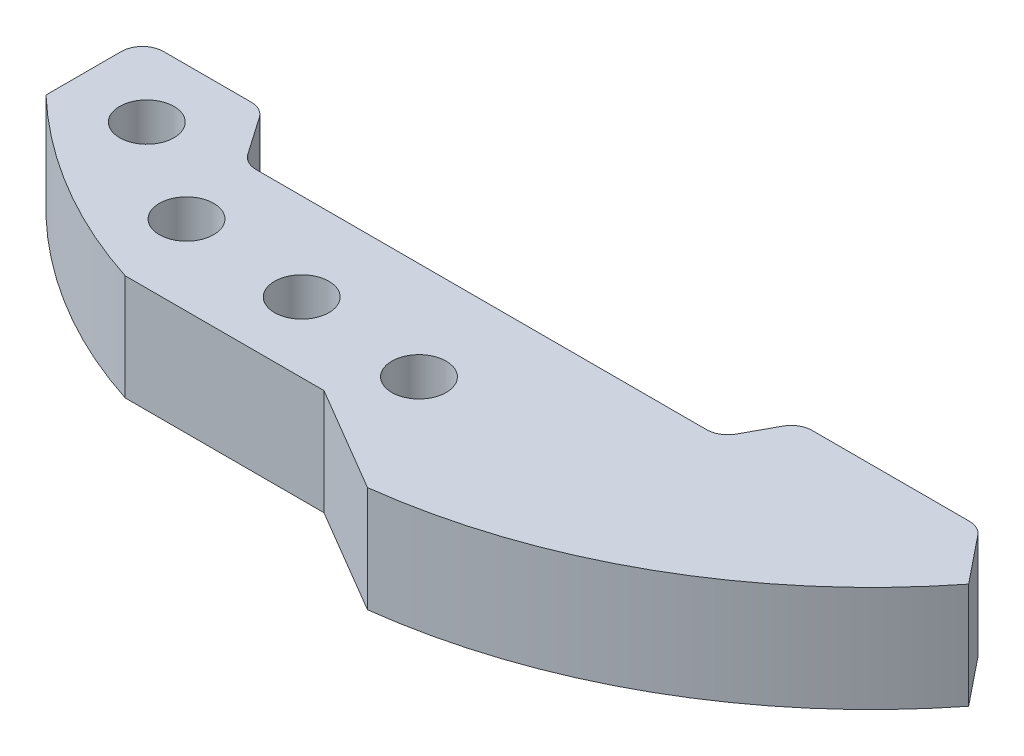
ISO-10303-21;
HEADER;
FILE_DESCRIPTION(('STEP AP214'),'2;1');
FILE_NAME('part.step','',(''),(''),'','','');
FILE_SCHEMA(('AUTOMOTIVE_DESIGN { 1 0 10303 214 1 1 1 1 }'));
ENDSEC;
DATA;
#1=APPLICATION_CONTEXT('core data for automotive mechanical design processes');
#2=APPLICATION_PROTOCOL_DEFINITION('international standard','automotive_design',2000,#1);
#3=PRODUCT_CONTEXT('',#1,'mechanical');
#4=PRODUCT('Part','Part','',(#3));
#5=PRODUCT_RELATED_PRODUCT_CATEGORY('part','',(#4));
#6=PRODUCT_DEFINITION_FORMATION('','',#4);
#7=PRODUCT_DEFINITION_CONTEXT('part definition',#1,'design');
#8=PRODUCT_DEFINITION('design','',#6,#7);
#9=PRODUCT_DEFINITION_SHAPE('','',#8);
#10=(LENGTH_UNIT() NAMED_UNIT(*) SI_UNIT(.MILLI.,.METRE.));
#11=(NAMED_UNIT(*) PLANE_ANGLE_UNIT() SI_UNIT($,.RADIAN.));
#12=(NAMED_UNIT(*) SI_UNIT($,.STERADIAN.) SOLID_ANGLE_UNIT());
#13=UNCERTAINTY_MEASURE_WITH_UNIT(LENGTH_MEASURE(1.E-05),#10,'distance_accuracy_value','');
#14=(GEOMETRIC_REPRESENTATION_CONTEXT(3) GLOBAL_UNCERTAINTY_ASSIGNED_CONTEXT((#13)) GLOBAL_UNIT_ASSIGNED_CONTEXT((#10,
#11,#12)) REPRESENTATION_CONTEXT('',''));
#15=CARTESIAN_POINT('',(0.,0.,0.));
#16=DIRECTION('',(0.,0.,1.));
#17=DIRECTION('',(1.,0.,0.));
#18=AXIS2_PLACEMENT_3D('',#15,#16,#17);
#19=CARTESIAN_POINT('',(-8.87325336655043,12.7,-2.54000000000001));
#20=DIRECTION('',(0.,-1.,0.));
#21=DIRECTION('',(0.,0.,-1.));
#22=AXIS2_PLACEMENT_3D('',#19,#20,#21);
#23=PLANE('',#22);
#24=CARTESIAN_POINT('',(7.10700109824777,12.7,10.5038351274323));
#25=DIRECTION('',(0.,1.,0.));
#26=DIRECTION('',(0.,0.,1.));
#27=AXIS2_PLACEMENT_3D('',#24,#25,#26);
#28=CIRCLE('',#27,3.2639);
#29=CARTESIAN_POINT('',(7.10700109824777,12.7,13.7677351274323));
#30=VERTEX_POINT('',#29);
#31=EDGE_CURVE('E355',#30,#30,#28,.T.);
#32=ORIENTED_EDGE('',*,*,#31,.F.);
#33=EDGE_LOOP('',(#32));
#34=FACE_BOUND('',#33,.T.);
#35=CARTESIAN_POINT('',(-20.3687877982319,12.7,1.62422244397765));
#36=DIRECTION('',(0.,1.,0.));
#37=DIRECTION('',(0.,0.,1.));
#38=AXIS2_PLACEMENT_3D('',#35,#36,#37);
#39=CIRCLE('',#38,3.2639);
#40=CARTESIAN_POINT('',(-20.3687877982319,12.7,4.88812244397765));
#41=VERTEX_POINT('',#40);
#42=EDGE_CURVE('E186',#41,#41,#39,.T.);
#43=ORIENTED_EDGE('',*,*,#42,.F.);
#44=EDGE_LOOP('',(#43));
#45=FACE_BOUND('',#44,.T.);
#46=CARTESIAN_POINT('',(-8.87325336655043,12.7,-2.54000000000001));
#47=DIRECTION('',(0.,-1.,0.));
#48=DIRECTION('',(0.,0.,-1.));
#49=AXIS2_PLACEMENT_3D('',#46,#47,#48);
#50=CIRCLE('',#49,2.54000000000001);
#51=CARTESIAN_POINT('',(-8.87325336655043,12.7,0.));
#52=VERTEX_POINT('',#51);
#53=CARTESIAN_POINT('',(-10.9603491429216,12.7,-1.0923704823907));
#54=VERTEX_POINT('',#53);
#55=EDGE_CURVE('E215',#52,#54,#50,.T.);
#56=ORIENTED_EDGE('',*,*,#55,.T.);
#57=DIRECTION('',(-0.569932880948545,0.,-0.821691250539819));
#58=VECTOR('',#57,1.);
#59=CARTESIAN_POINT('',(-14.1041656400549,12.7,-5.62491562121108));
#60=LINE('',#59,#58);
#61=CARTESIAN_POINT('',(-14.1041656400549,12.7,-5.62491562121108));
#62=VERTEX_POINT('',#61);
#63=EDGE_CURVE('E118',#54,#62,#60,.T.);
#64=ORIENTED_EDGE('',*,*,#63,.T.);
#65=CARTESIAN_POINT('',(-16.1912614164261,12.7,-4.17728610360175));
#66=DIRECTION('',(0.,1.,0.));
#67=DIRECTION('',(0.,0.,-1.));
#68=AXIS2_PLACEMENT_3D('',#65,#66,#67);
#69=CIRCLE('',#68,2.54000000000002);
#70=CARTESIAN_POINT('',(-16.1912614164261,12.7,-6.71728610360177));
#71=VERTEX_POINT('',#70);
#72=EDGE_CURVE('E257',#62,#71,#69,.T.);
#73=ORIENTED_EDGE('',*,*,#72,.T.);
#74=DIRECTION('',(-1.,0.,0.));
#75=VECTOR('',#74,1.);
#76=CARTESIAN_POINT('',(-26.693758610171,12.7,-6.71728610360177));
#77=LINE('',#76,#75);
#78=CARTESIAN_POINT('',(-26.693758610171,12.7,-6.71728610360177));
#79=VERTEX_POINT('',#78);
#80=EDGE_CURVE('E276',#71,#79,#77,.T.);
#81=ORIENTED_EDGE('',*,*,#80,.T.);
#82=CARTESIAN_POINT('',(-26.693758610171,12.7,-4.17728610360177));
#83=DIRECTION('',(0.,1.,0.));
#84=DIRECTION('',(0.,0.,1.));
#85=AXIS2_PLACEMENT_3D('',#82,#83,#84);
#86=CIRCLE('',#85,2.54);
#87=CARTESIAN_POINT('',(-29.233758610171,12.7,-4.17728610360177));
#88=VERTEX_POINT('',#87);
#89=EDGE_CURVE('E273',#79,#88,#86,.T.);
#90=ORIENTED_EDGE('',*,*,#89,.T.);
#91=DIRECTION('',(0.,0.,1.));
#92=VECTOR('',#91,1.);
#93=CARTESIAN_POINT('',(-29.233758610171,12.7,4.85526249752581));
#94=LINE('',#93,#92);
#95=CARTESIAN_POINT('',(-29.233758610171,12.7,4.85526249752581));
#96=VERTEX_POINT('',#95);
#97=EDGE_CURVE('E275',#88,#96,#94,.T.);
#98=ORIENTED_EDGE('',*,*,#97,.T.);
#99=CARTESIAN_POINT('',(13.2373230450573,12.7,-39.6028183966999));
#100=DIRECTION('',(0.,1.,0.));
#101=DIRECTION('',(0.,0.,1.));
#102=AXIS2_PLACEMENT_3D('',#99,#100,#101);
#103=CIRCLE('',#102,61.4842559828334);
#104=CARTESIAN_POINT('',(-5.68881718617444,12.7,18.8960273159322));
#105=VERTEX_POINT('',#104);
#106=EDGE_CURVE('E278',#96,#105,#103,.T.);
#107=ORIENTED_EDGE('',*,*,#106,.T.);
#108=DIRECTION('',(1.,0.,0.));
#109=VECTOR('',#108,1.);
#110=CARTESIAN_POINT('',(18.1655195514172,12.7,18.8960273159322));
#111=LINE('',#110,#109);
#112=CARTESIAN_POINT('',(18.1655195514172,12.7,18.8960273159322));
#113=VERTEX_POINT('',#112);
#114=EDGE_CURVE('E284',#105,#113,#111,.T.);
#115=ORIENTED_EDGE('',*,*,#114,.T.);
#116=DIRECTION('',(0.861850565348873,0.,0.507162304403461));
#117=VECTOR('',#116,1.);
#118=CARTESIAN_POINT('',(30.8655195514172,12.7,26.3694357290446));
#119=LINE('',#118,#117);
#120=CARTESIAN_POINT('',(30.8655195514172,12.7,26.3694357290446));
#121=VERTEX_POINT('',#120);
#122=EDGE_CURVE('E286',#113,#121,#119,.T.);
#123=ORIENTED_EDGE('',*,*,#122,.T.);
#124=CARTESIAN_POINT('',(22.208753694901,12.7,-42.7961792049553));
#125=DIRECTION('',(0.,1.,0.));
#126=DIRECTION('',(0.,0.,1.));
#127=AXIS2_PLACEMENT_3D('',#124,#125,#126);
#128=CIRCLE('',#127,69.7052500482776);
#129=CARTESIAN_POINT('',(76.9724106715689,12.7,0.328799158340741));
#130=VERTEX_POINT('',#129);
#131=EDGE_CURVE('E288',#121,#130,#128,.T.);
#132=ORIENTED_EDGE('',*,*,#131,.T.);
#133=DIRECTION('',(-0.626647693307353,0.,-0.779302680909397));
#134=VECTOR('',#133,1.);
#135=CARTESIAN_POINT('',(72.4415160323198,12.7,-5.30584751313917));
#136=LINE('',#135,#134);
#137=CARTESIAN_POINT('',(72.4415160323198,12.7,-5.30584751313917));
#138=VERTEX_POINT('',#137);
#139=EDGE_CURVE('E290',#130,#138,#136,.T.);
#140=ORIENTED_EDGE('',*,*,#139,.T.);
#141=CARTESIAN_POINT('',(70.46208722281,12.7,-3.71416237213849));
#142=DIRECTION('',(0.,1.,0.));
#143=DIRECTION('',(0.,0.,-1.));
#144=AXIS2_PLACEMENT_3D('',#141,#142,#143);
#145=CIRCLE('',#144,2.54000000000001);
#146=CARTESIAN_POINT('',(70.46208722281,12.7,-6.2541623721385));
#147=VERTEX_POINT('',#146);
#148=EDGE_CURVE('E292',#138,#147,#145,.T.);
#149=ORIENTED_EDGE('',*,*,#148,.T.);
#150=DIRECTION('',(-1.,0.,0.));
#151=VECTOR('',#150,1.);
#152=CARTESIAN_POINT('',(51.6232888953784,12.7,-6.2541623721385));
#153=LINE('',#152,#151);
#154=CARTESIAN_POINT('',(51.6232888953784,12.7,-6.2541623721385));
#155=VERTEX_POINT('',#154);
#156=EDGE_CURVE('E294',#147,#155,#153,.T.);
#157=ORIENTED_EDGE('',*,*,#156,.T.);
#158=CARTESIAN_POINT('',(51.6232888953784,12.7,-3.71416237213848));
#159=DIRECTION('',(0.,1.,0.));
#160=DIRECTION('',(0.,0.,1.));
#161=AXIS2_PLACEMENT_3D('',#158,#159,#160);
#162=CIRCLE('',#161,2.54000000000002);
#163=CARTESIAN_POINT('',(49.3913485967309,12.7,-4.92661546536457));
#164=VERTEX_POINT('',#163);
#165=EDGE_CURVE('E164',#155,#164,#162,.T.);
#166=ORIENTED_EDGE('',*,*,#165,.T.);
#167=DIRECTION('',(-0.477343737490577,0.,0.878716653010814));
#168=VECTOR('',#167,1.);
#169=CARTESIAN_POINT('',(49.3913485967309,12.7,-4.92661546536457));
#170=LINE('',#169,#168);
#171=CARTESIAN_POINT('',(47.4362327680324,12.7,-1.32754690677394));
#172=VERTEX_POINT('',#171);
#173=EDGE_CURVE('E158',#164,#172,#170,.T.);
#174=ORIENTED_EDGE('',*,*,#173,.T.);
#175=CARTESIAN_POINT('',(45.2042924693849,12.7,-2.54));
#176=DIRECTION('',(0.,-1.,0.));
#177=DIRECTION('',(0.,0.,1.));
#178=AXIS2_PLACEMENT_3D('',#175,#176,#177);
#179=CIRCLE('',#178,2.54000000000001);
#180=CARTESIAN_POINT('',(45.2042924693849,12.7,0.));
#181=VERTEX_POINT('',#180);
#182=EDGE_CURVE('E162',#172,#181,#179,.T.);
#183=ORIENTED_EDGE('',*,*,#182,.T.);
#184=DIRECTION('',(-1.,0.,0.));
#185=VECTOR('',#184,1.);
#186=CARTESIAN_POINT('',(-8.87325336655043,12.7,0.));
#187=LINE('',#186,#185);
#188=EDGE_CURVE('E48',#181,#52,#187,.T.);
#189=ORIENTED_EDGE('',*,*,#188,.T.);
#190=EDGE_LOOP('',(#56,#64,#73,#81,#90,#98,#107,#115,#123,#132,#140,#149,#157,#166,#174,#183,#189));
#191=FACE_BOUND('',#190,.T.);
#192=CARTESIAN_POINT('',(-7.90836526641105,12.7,9.31714485622794));
#193=DIRECTION('',(0.,1.,0.));
#194=DIRECTION('',(0.,0.,1.));
#195=AXIS2_PLACEMENT_3D('',#192,#193,#194);
#196=CIRCLE('',#195,3.2639);
#197=CARTESIAN_POINT('',(-7.90836526641105,12.7,12.5810448562279));
#198=VERTEX_POINT('',#197);
#199=EDGE_CURVE('E361',#198,#198,#196,.T.);
#200=ORIENTED_EDGE('',*,*,#199,.F.);
#201=EDGE_LOOP('',(#200));
#202=FACE_BOUND('',#201,.T.);
#203=CARTESIAN_POINT('',(22.4448241892799,12.7,11.7674823636149));
#204=DIRECTION('',(0.,1.,0.));
#205=DIRECTION('',(0.,0.,1.));
#206=AXIS2_PLACEMENT_3D('',#203,#204,#205);
#207=CIRCLE('',#206,3.2639);
#208=CARTESIAN_POINT('',(22.4448241892799,12.7,15.0313823636149));
#209=VERTEX_POINT('',#208);
#210=EDGE_CURVE('E346',#209,#209,#207,.T.);
#211=ORIENTED_EDGE('',*,*,#210,.F.);
#212=EDGE_LOOP('',(#211));
#213=FACE_BOUND('',#212,.T.);
#214=ADVANCED_FACE('F31',(#34,#45,#191,#202,#213),#23,.F.);
#215=CARTESIAN_POINT('',(-8.87325336655043,0.,-2.54000000000001));
#216=DIRECTION('',(0.,-1.,0.));
#217=DIRECTION('',(0.,0.,-1.));
#218=AXIS2_PLACEMENT_3D('',#215,#216,#217);
#219=PLANE('',#218);
#220=CARTESIAN_POINT('',(7.10700109824777,0.,10.5038351274323));
#221=DIRECTION('',(0.,1.,0.));
#222=DIRECTION('',(0.,0.,1.));
#223=AXIS2_PLACEMENT_3D('',#220,#221,#222);
#224=CIRCLE('',#223,3.2639);
#225=CARTESIAN_POINT('',(7.10700109824777,0.,13.7677351274323));
#226=VERTEX_POINT('',#225);
#227=EDGE_CURVE('E352',#226,#226,#224,.T.);
#228=ORIENTED_EDGE('',*,*,#227,.T.);
#229=EDGE_LOOP('',(#228));
#230=FACE_BOUND('',#229,.T.);
#231=CARTESIAN_POINT('',(-20.3687877982319,0.,1.62422244397765));
#232=DIRECTION('',(0.,1.,0.));
#233=DIRECTION('',(0.,0.,1.));
#234=AXIS2_PLACEMENT_3D('',#231,#232,#233);
#235=CIRCLE('',#234,3.2639);
#236=CARTESIAN_POINT('',(-20.3687877982319,0.,4.88812244397765));
#237=VERTEX_POINT('',#236);
#238=EDGE_CURVE('E364',#237,#237,#235,.T.);
#239=ORIENTED_EDGE('',*,*,#238,.T.);
#240=EDGE_LOOP('',(#239));
#241=FACE_BOUND('',#240,.T.);
#242=CARTESIAN_POINT('',(-8.87325336655043,0.,-2.54000000000001));
#243=DIRECTION('',(0.,-1.,0.));
#244=DIRECTION('',(0.,0.,-1.));
#245=AXIS2_PLACEMENT_3D('',#242,#243,#244);
#246=CIRCLE('',#245,2.54000000000001);
#247=CARTESIAN_POINT('',(-8.87325336655043,0.,0.));
#248=VERTEX_POINT('',#247);
#249=CARTESIAN_POINT('',(-10.9603491429216,0.,-1.0923704823907));
#250=VERTEX_POINT('',#249);
#251=EDGE_CURVE('E182',#248,#250,#246,.T.);
#252=ORIENTED_EDGE('',*,*,#251,.F.);
#253=DIRECTION('',(-1.,0.,0.));
#254=VECTOR('',#253,1.);
#255=CARTESIAN_POINT('',(-8.87325336655043,0.,0.));
#256=LINE('',#255,#254);
#257=CARTESIAN_POINT('',(45.2042924693849,0.,0.));
#258=VERTEX_POINT('',#257);
#259=EDGE_CURVE('E110',#258,#248,#256,.T.);
#260=ORIENTED_EDGE('',*,*,#259,.F.);
#261=CARTESIAN_POINT('',(45.2042924693849,0.,-2.54));
#262=DIRECTION('',(0.,-1.,0.));
#263=DIRECTION('',(0.,0.,1.));
#264=AXIS2_PLACEMENT_3D('',#261,#262,#263);
#265=CIRCLE('',#264,2.54000000000001);
#266=CARTESIAN_POINT('',(47.4362327680324,0.,-1.32754690677394));
#267=VERTEX_POINT('',#266);
#268=EDGE_CURVE('E104',#267,#258,#265,.T.);
#269=ORIENTED_EDGE('',*,*,#268,.F.);
#270=DIRECTION('',(-0.477343737490577,0.,0.878716653010814));
#271=VECTOR('',#270,1.);
#272=CARTESIAN_POINT('',(49.3913485967309,0.,-4.92661546536457));
#273=LINE('',#272,#271);
#274=CARTESIAN_POINT('',(49.3913485967309,0.,-4.92661546536457));
#275=VERTEX_POINT('',#274);
#276=EDGE_CURVE('E172',#275,#267,#273,.T.);
#277=ORIENTED_EDGE('',*,*,#276,.F.);
#278=CARTESIAN_POINT('',(51.6232888953784,0.,-3.71416237213848));
#279=DIRECTION('',(0.,1.,0.));
#280=DIRECTION('',(0.,0.,1.));
#281=AXIS2_PLACEMENT_3D('',#278,#279,#280);
#282=CIRCLE('',#281,2.54000000000002);
#283=CARTESIAN_POINT('',(51.6232888953784,0.,-6.2541623721385));
#284=VERTEX_POINT('',#283);
#285=EDGE_CURVE('E210',#284,#275,#282,.T.);
#286=ORIENTED_EDGE('',*,*,#285,.F.);
#287=DIRECTION('',(-1.,0.,0.));
#288=VECTOR('',#287,1.);
#289=CARTESIAN_POINT('',(51.6232888953784,0.,-6.2541623721385));
#290=LINE('',#289,#288);
#291=CARTESIAN_POINT('',(70.46208722281,0.,-6.2541623721385));
#292=VERTEX_POINT('',#291);
#293=EDGE_CURVE('E208',#292,#284,#290,.T.);
#294=ORIENTED_EDGE('',*,*,#293,.F.);
#295=CARTESIAN_POINT('',(70.46208722281,0.,-3.71416237213849));
#296=DIRECTION('',(0.,1.,0.));
#297=DIRECTION('',(0.,0.,-1.));
#298=AXIS2_PLACEMENT_3D('',#295,#296,#297);
#299=CIRCLE('',#298,2.54000000000001);
#300=CARTESIAN_POINT('',(72.4415160323198,0.,-5.30584751313917));
#301=VERTEX_POINT('',#300);
#302=EDGE_CURVE('E206',#301,#292,#299,.T.);
#303=ORIENTED_EDGE('',*,*,#302,.F.);
#304=DIRECTION('',(-0.626647693307353,0.,-0.779302680909397));
#305=VECTOR('',#304,1.);
#306=CARTESIAN_POINT('',(72.4415160323198,0.,-5.30584751313917));
#307=LINE('',#306,#305);
#308=CARTESIAN_POINT('',(76.9724106715689,0.,0.328799158340741));
#309=VERTEX_POINT('',#308);
#310=EDGE_CURVE('E204',#309,#301,#307,.T.);
#311=ORIENTED_EDGE('',*,*,#310,.F.);
#312=CARTESIAN_POINT('',(22.208753694901,0.,-42.7961792049553));
#313=DIRECTION('',(0.,1.,0.));
#314=DIRECTION('',(0.,0.,1.));
#315=AXIS2_PLACEMENT_3D('',#312,#313,#314);
#316=CIRCLE('',#315,69.7052500482776);
#317=CARTESIAN_POINT('',(30.8655195514172,0.,26.3694357290446));
#318=VERTEX_POINT('',#317);
#319=EDGE_CURVE('E202',#318,#309,#316,.T.);
#320=ORIENTED_EDGE('',*,*,#319,.F.);
#321=DIRECTION('',(0.861850565348873,0.,0.507162304403461));
#322=VECTOR('',#321,1.);
#323=CARTESIAN_POINT('',(30.8655195514172,0.,26.3694357290446));
#324=LINE('',#323,#322);
#325=CARTESIAN_POINT('',(18.1655195514172,0.,18.8960273159322));
#326=VERTEX_POINT('',#325);
#327=EDGE_CURVE('E200',#326,#318,#324,.T.);
#328=ORIENTED_EDGE('',*,*,#327,.F.);
#329=DIRECTION('',(1.,0.,0.));
#330=VECTOR('',#329,1.);
#331=CARTESIAN_POINT('',(18.1655195514172,0.,18.8960273159322));
#332=LINE('',#331,#330);
#333=CARTESIAN_POINT('',(-5.68881718617444,0.,18.8960273159322));
#334=VERTEX_POINT('',#333);
#335=EDGE_CURVE('E198',#334,#326,#332,.T.);
#336=ORIENTED_EDGE('',*,*,#335,.F.);
#337=CARTESIAN_POINT('',(13.2373230450573,0.,-39.6028183966999));
#338=DIRECTION('',(0.,1.,0.));
#339=DIRECTION('',(0.,0.,1.));
#340=AXIS2_PLACEMENT_3D('',#337,#338,#339);
#341=CIRCLE('',#340,61.4842559828334);
#342=CARTESIAN_POINT('',(-29.233758610171,0.,4.85526249752581));
#343=VERTEX_POINT('',#342);
#344=EDGE_CURVE('E196',#343,#334,#341,.T.);
#345=ORIENTED_EDGE('',*,*,#344,.F.);
#346=DIRECTION('',(0.,0.,1.));
#347=VECTOR('',#346,1.);
#348=CARTESIAN_POINT('',(-29.233758610171,0.,4.85526249752581));
#349=LINE('',#348,#347);
#350=CARTESIAN_POINT('',(-29.233758610171,0.,-4.17728610360177));
#351=VERTEX_POINT('',#350);
#352=EDGE_CURVE('E194',#351,#343,#349,.T.);
#353=ORIENTED_EDGE('',*,*,#352,.F.);
#354=CARTESIAN_POINT('',(-26.693758610171,0.,-4.17728610360177));
#355=DIRECTION('',(0.,1.,0.));
#356=DIRECTION('',(0.,0.,1.));
#357=AXIS2_PLACEMENT_3D('',#354,#355,#356);
#358=CIRCLE('',#357,2.54);
#359=CARTESIAN_POINT('',(-26.693758610171,0.,-6.71728610360177));
#360=VERTEX_POINT('',#359);
#361=EDGE_CURVE('E192',#360,#351,#358,.T.);
#362=ORIENTED_EDGE('',*,*,#361,.F.);
#363=DIRECTION('',(-1.,0.,0.));
#364=VECTOR('',#363,1.);
#365=CARTESIAN_POINT('',(-26.693758610171,0.,-6.71728610360177));
#366=LINE('',#365,#364);
#367=CARTESIAN_POINT('',(-16.1912614164261,0.,-6.71728610360177));
#368=VERTEX_POINT('',#367);
#369=EDGE_CURVE('E190',#368,#360,#366,.T.);
#370=ORIENTED_EDGE('',*,*,#369,.F.);
#371=CARTESIAN_POINT('',(-16.1912614164261,0.,-4.17728610360175));
#372=DIRECTION('',(0.,1.,0.));
#373=DIRECTION('',(0.,0.,-1.));
#374=AXIS2_PLACEMENT_3D('',#371,#372,#373);
#375=CIRCLE('',#374,2.54000000000002);
#376=CARTESIAN_POINT('',(-14.1041656400549,0.,-5.62491562121108));
#377=VERTEX_POINT('',#376);
#378=EDGE_CURVE('E188',#377,#368,#375,.T.);
#379=ORIENTED_EDGE('',*,*,#378,.F.);
#380=DIRECTION('',(-0.569932880948545,0.,-0.821691250539819));
#381=VECTOR('',#380,1.);
#382=CARTESIAN_POINT('',(-14.1041656400549,0.,-5.62491562121108));
#383=LINE('',#382,#381);
#384=EDGE_CURVE('E185',#250,#377,#383,.T.);
#385=ORIENTED_EDGE('',*,*,#384,.F.);
#386=EDGE_LOOP('',(#252,#260,#269,#277,#286,#294,#303,#311,#320,#328,#336,#345,#353,#362,#370,
#379,#385));
#387=FACE_BOUND('',#386,.T.);
#388=CARTESIAN_POINT('',(-7.90836526641105,0.,9.31714485622794));
#389=DIRECTION('',(0.,1.,0.));
#390=DIRECTION('',(0.,0.,1.));
#391=AXIS2_PLACEMENT_3D('',#388,#389,#390);
#392=CIRCLE('',#391,3.2639);
#393=CARTESIAN_POINT('',(-7.90836526641105,0.,12.5810448562279));
#394=VERTEX_POINT('',#393);
#395=EDGE_CURVE('E358',#394,#394,#392,.T.);
#396=ORIENTED_EDGE('',*,*,#395,.T.);
#397=EDGE_LOOP('',(#396));
#398=FACE_BOUND('',#397,.T.);
#399=CARTESIAN_POINT('',(22.4448241892799,0.,11.7674823636149));
#400=DIRECTION('',(0.,1.,0.));
#401=DIRECTION('',(0.,0.,1.));
#402=AXIS2_PLACEMENT_3D('',#399,#400,#401);
#403=CIRCLE('',#402,3.2639);
#404=CARTESIAN_POINT('',(22.4448241892799,0.,15.0313823636149));
#405=VERTEX_POINT('',#404);
#406=EDGE_CURVE('E349',#405,#405,#403,.T.);
#407=ORIENTED_EDGE('',*,*,#406,.T.);
#408=EDGE_LOOP('',(#407));
#409=FACE_BOUND('',#408,.T.);
#410=ADVANCED_FACE('F261',(#230,#241,#387,#398,#409),#219,.T.);
#411=CARTESIAN_POINT('',(-8.87325336655043,12.7,-2.54000000000001));
#412=DIRECTION('',(0.,-1.,0.));
#413=DIRECTION('',(0.,0.,-1.));
#414=AXIS2_PLACEMENT_3D('',#411,#412,#413);
#415=CYLINDRICAL_SURFACE('',#414,2.54000000000001);
#416=ORIENTED_EDGE('',*,*,#251,.T.);
#417=DIRECTION('',(0.,-1.,0.));
#418=VECTOR('',#417,1.);
#419=CARTESIAN_POINT('',(-10.9603491429216,12.7,-1.0923704823907));
#420=LINE('',#419,#418);
#421=EDGE_CURVE('E11',#54,#250,#420,.T.);
#422=ORIENTED_EDGE('',*,*,#421,.F.);
#423=ORIENTED_EDGE('',*,*,#55,.F.);
#424=DIRECTION('',(0.,-1.,0.));
#425=VECTOR('',#424,1.);
#426=CARTESIAN_POINT('',(-8.87325336655043,12.7,0.));
#427=LINE('',#426,#425);
#428=EDGE_CURVE('E178',#52,#248,#427,.T.);
#429=ORIENTED_EDGE('',*,*,#428,.T.);
#430=EDGE_LOOP('',(#416,#422,#423,#429));
#431=FACE_BOUND('',#430,.T.);
#432=ADVANCED_FACE('F33',(#431),#415,.F.);
#433=CARTESIAN_POINT('',(-14.1041656400549,12.7,-5.62491562121108));
#434=DIRECTION('',(-0.821691250539819,0.,0.569932880948545));
#435=DIRECTION('',(0.569932880948545,0.,0.821691250539819));
#436=AXIS2_PLACEMENT_3D('',#433,#434,#435);
#437=PLANE('',#436);
#438=ORIENTED_EDGE('',*,*,#384,.T.);
#439=DIRECTION('',(0.,-1.,0.));
#440=VECTOR('',#439,1.);
#441=CARTESIAN_POINT('',(-14.1041656400549,12.7,-5.62491562121108));
#442=LINE('',#441,#440);
#443=EDGE_CURVE('E40',#62,#377,#442,.T.);
#444=ORIENTED_EDGE('',*,*,#443,.F.);
#445=ORIENTED_EDGE('',*,*,#63,.F.);
#446=ORIENTED_EDGE('',*,*,#421,.T.);
#447=EDGE_LOOP('',(#438,#444,#445,#446));
#448=FACE_BOUND('',#447,.T.);
#449=ADVANCED_FACE('F523',(#448),#437,.F.);
#450=CARTESIAN_POINT('',(-16.1912614164261,12.7,-4.17728610360175));
#451=DIRECTION('',(0.,-1.,0.));
#452=DIRECTION('',(0.,0.,-1.));
#453=AXIS2_PLACEMENT_3D('',#450,#451,#452);
#454=CYLINDRICAL_SURFACE('',#453,2.54000000000002);
#455=ORIENTED_EDGE('',*,*,#378,.T.);
#456=DIRECTION('',(0.,-1.,0.));
#457=VECTOR('',#456,1.);
#458=CARTESIAN_POINT('',(-16.1912614164261,12.7,-6.71728610360177));
#459=LINE('',#458,#457);
#460=EDGE_CURVE('E249',#71,#368,#459,.T.);
#461=ORIENTED_EDGE('',*,*,#460,.F.);
#462=ORIENTED_EDGE('',*,*,#72,.F.);
#463=ORIENTED_EDGE('',*,*,#443,.T.);
#464=EDGE_LOOP('',(#455,#461,#462,#463));
#465=FACE_BOUND('',#464,.T.);
#466=ADVANCED_FACE('F255',(#465),#454,.T.);
#467=CARTESIAN_POINT('',(-26.693758610171,12.7,-6.71728610360177));
#468=DIRECTION('',(0.,0.,1.));
#469=DIRECTION('',(1.,0.,0.));
#470=AXIS2_PLACEMENT_3D('',#467,#468,#469);
#471=PLANE('',#470);
#472=ORIENTED_EDGE('',*,*,#369,.T.);
#473=DIRECTION('',(0.,-1.,0.));
#474=VECTOR('',#473,1.);
#475=CARTESIAN_POINT('',(-26.693758610171,12.7,-6.71728610360177));
#476=LINE('',#475,#474);
#477=EDGE_CURVE('E246',#79,#360,#476,.T.);
#478=ORIENTED_EDGE('',*,*,#477,.F.);
#479=ORIENTED_EDGE('',*,*,#80,.F.);
#480=ORIENTED_EDGE('',*,*,#460,.T.);
#481=EDGE_LOOP('',(#472,#478,#479,#480));
#482=FACE_BOUND('',#481,.T.);
#483=ADVANCED_FACE('F267',(#482),#471,.F.);
#484=CARTESIAN_POINT('',(-26.693758610171,12.7,-4.17728610360177));
#485=DIRECTION('',(0.,-1.,0.));
#486=DIRECTION('',(0.,0.,-1.));
#487=AXIS2_PLACEMENT_3D('',#484,#485,#486);
#488=CYLINDRICAL_SURFACE('',#487,2.54);
#489=ORIENTED_EDGE('',*,*,#361,.T.);
#490=DIRECTION('',(0.,-1.,0.));
#491=VECTOR('',#490,1.);
#492=CARTESIAN_POINT('',(-29.233758610171,12.7,-4.17728610360177));
#493=LINE('',#492,#491);
#494=EDGE_CURVE('E243',#88,#351,#493,.T.);
#495=ORIENTED_EDGE('',*,*,#494,.F.);
#496=ORIENTED_EDGE('',*,*,#89,.F.);
#497=ORIENTED_EDGE('',*,*,#477,.T.);
#498=EDGE_LOOP('',(#489,#495,#496,#497));
#499=FACE_BOUND('',#498,.T.);
#500=ADVANCED_FACE('F271',(#499),#488,.T.);
#501=CARTESIAN_POINT('',(-29.233758610171,12.7,4.85526249752581));
#502=DIRECTION('',(1.,0.,0.));
#503=DIRECTION('',(0.,0.,-1.));
#504=AXIS2_PLACEMENT_3D('',#501,#502,#503);
#505=PLANE('',#504);
#506=ORIENTED_EDGE('',*,*,#352,.T.);
#507=DIRECTION('',(0.,-1.,0.));
#508=VECTOR('',#507,1.);
#509=CARTESIAN_POINT('',(-29.233758610171,12.7,4.85526249752581));
#510=LINE('',#509,#508);
#511=EDGE_CURVE('E240',#96,#343,#510,.T.);
#512=ORIENTED_EDGE('',*,*,#511,.F.);
#513=ORIENTED_EDGE('',*,*,#97,.F.);
#514=ORIENTED_EDGE('',*,*,#494,.T.);
#515=EDGE_LOOP('',(#506,#512,#513,#514));
#516=FACE_BOUND('',#515,.T.);
#517=ADVANCED_FACE('F488',(#516),#505,.F.);
#518=CARTESIAN_POINT('',(13.2373230450573,12.7,-39.6028183966999));
#519=DIRECTION('',(0.,-1.,0.));
#520=DIRECTION('',(0.,0.,-1.));
#521=AXIS2_PLACEMENT_3D('',#518,#519,#520);
#522=CYLINDRICAL_SURFACE('',#521,61.4842559828334);
#523=ORIENTED_EDGE('',*,*,#344,.T.);
#524=DIRECTION('',(0.,-1.,0.));
#525=VECTOR('',#524,1.);
#526=CARTESIAN_POINT('',(-5.68881718617444,12.7,18.8960273159322));
#527=LINE('',#526,#525);
#528=EDGE_CURVE('E237',#105,#334,#527,.T.);
#529=ORIENTED_EDGE('',*,*,#528,.F.);
#530=ORIENTED_EDGE('',*,*,#106,.F.);
#531=ORIENTED_EDGE('',*,*,#511,.T.);
#532=EDGE_LOOP('',(#523,#529,#530,#531));
#533=FACE_BOUND('',#532,.T.);
#534=ADVANCED_FACE('F478',(#533),#522,.T.);
#535=CARTESIAN_POINT('',(18.1655195514172,12.7,18.8960273159322));
#536=DIRECTION('',(0.,0.,-1.));
#537=DIRECTION('',(-1.,0.,0.));
#538=AXIS2_PLACEMENT_3D('',#535,#536,#537);
#539=PLANE('',#538);
#540=ORIENTED_EDGE('',*,*,#335,.T.);
#541=DIRECTION('',(0.,-1.,0.));
#542=VECTOR('',#541,1.);
#543=CARTESIAN_POINT('',(18.1655195514172,12.7,18.8960273159322));
#544=LINE('',#543,#542);
#545=EDGE_CURVE('E234',#113,#326,#544,.T.);
#546=ORIENTED_EDGE('',*,*,#545,.F.);
#547=ORIENTED_EDGE('',*,*,#114,.F.);
#548=ORIENTED_EDGE('',*,*,#528,.T.);
#549=EDGE_LOOP('',(#540,#546,#547,#548));
#550=FACE_BOUND('',#549,.T.);
#551=ADVANCED_FACE('F468',(#550),#539,.F.);
#552=CARTESIAN_POINT('',(30.8655195514172,12.7,26.3694357290446));
#553=DIRECTION('',(0.507162304403461,0.,-0.861850565348873));
#554=DIRECTION('',(-0.861850565348873,0.,-0.507162304403461));
#555=AXIS2_PLACEMENT_3D('',#552,#553,#554);
#556=PLANE('',#555);
#557=ORIENTED_EDGE('',*,*,#327,.T.);
#558=DIRECTION('',(0.,-1.,0.));
#559=VECTOR('',#558,1.);
#560=CARTESIAN_POINT('',(30.8655195514172,12.7,26.3694357290446));
#561=LINE('',#560,#559);
#562=EDGE_CURVE('E231',#121,#318,#561,.T.);
#563=ORIENTED_EDGE('',*,*,#562,.F.);
#564=ORIENTED_EDGE('',*,*,#122,.F.);
#565=ORIENTED_EDGE('',*,*,#545,.T.);
#566=EDGE_LOOP('',(#557,#563,#564,#565));
#567=FACE_BOUND('',#566,.T.);
#568=ADVANCED_FACE('F458',(#567),#556,.F.);
#569=CARTESIAN_POINT('',(22.208753694901,12.7,-42.7961792049553));
#570=DIRECTION('',(0.,-1.,0.));
#571=DIRECTION('',(0.,0.,-1.));
#572=AXIS2_PLACEMENT_3D('',#569,#570,#571);
#573=CYLINDRICAL_SURFACE('',#572,69.7052500482776);
#574=ORIENTED_EDGE('',*,*,#319,.T.);
#575=DIRECTION('',(0.,-1.,0.));
#576=VECTOR('',#575,1.);
#577=CARTESIAN_POINT('',(76.9724106715689,12.7,0.328799158340741));
#578=LINE('',#577,#576);
#579=EDGE_CURVE('E228',#130,#309,#578,.T.);
#580=ORIENTED_EDGE('',*,*,#579,.F.);
#581=ORIENTED_EDGE('',*,*,#131,.F.);
#582=ORIENTED_EDGE('',*,*,#562,.T.);
#583=EDGE_LOOP('',(#574,#580,#581,#582));
#584=FACE_BOUND('',#583,.T.);
#585=ADVANCED_FACE('F448',(#584),#573,.T.);
#586=CARTESIAN_POINT('',(72.4415160323198,12.7,-5.30584751313917));
#587=DIRECTION('',(-0.779302680909397,0.,0.626647693307353));
#588=DIRECTION('',(0.626647693307353,0.,0.779302680909397));
#589=AXIS2_PLACEMENT_3D('',#586,#587,#588);
#590=PLANE('',#589);
#591=ORIENTED_EDGE('',*,*,#310,.T.);
#592=DIRECTION('',(0.,-1.,0.));
#593=VECTOR('',#592,1.);
#594=CARTESIAN_POINT('',(72.4415160323198,12.7,-5.30584751313917));
#595=LINE('',#594,#593);
#596=EDGE_CURVE('E225',#138,#301,#595,.T.);
#597=ORIENTED_EDGE('',*,*,#596,.F.);
#598=ORIENTED_EDGE('',*,*,#139,.F.);
#599=ORIENTED_EDGE('',*,*,#579,.T.);
#600=EDGE_LOOP('',(#591,#597,#598,#599));
#601=FACE_BOUND('',#600,.T.);
#602=ADVANCED_FACE('F438',(#601),#590,.F.);
#603=CARTESIAN_POINT('',(70.46208722281,12.7,-3.71416237213849));
#604=DIRECTION('',(0.,-1.,0.));
#605=DIRECTION('',(0.,0.,-1.));
#606=AXIS2_PLACEMENT_3D('',#603,#604,#605);
#607=CYLINDRICAL_SURFACE('',#606,2.54000000000001);
#608=ORIENTED_EDGE('',*,*,#302,.T.);
#609=DIRECTION('',(0.,-1.,0.));
#610=VECTOR('',#609,1.);
#611=CARTESIAN_POINT('',(70.46208722281,12.7,-6.2541623721385));
#612=LINE('',#611,#610);
#613=EDGE_CURVE('E222',#147,#292,#612,.T.);
#614=ORIENTED_EDGE('',*,*,#613,.F.);
#615=ORIENTED_EDGE('',*,*,#148,.F.);
#616=ORIENTED_EDGE('',*,*,#596,.T.);
#617=EDGE_LOOP('',(#608,#614,#615,#616));
#618=FACE_BOUND('',#617,.T.);
#619=ADVANCED_FACE('F429',(#618),#607,.T.);
#620=CARTESIAN_POINT('',(51.6232888953784,12.7,-6.2541623721385));
#621=DIRECTION('',(0.,0.,1.));
#622=DIRECTION('',(1.,0.,0.));
#623=AXIS2_PLACEMENT_3D('',#620,#621,#622);
#624=PLANE('',#623);
#625=ORIENTED_EDGE('',*,*,#293,.T.);
#626=DIRECTION('',(0.,-1.,0.));
#627=VECTOR('',#626,1.);
#628=CARTESIAN_POINT('',(51.6232888953784,12.7,-6.2541623721385));
#629=LINE('',#628,#627);
#630=EDGE_CURVE('E219',#155,#284,#629,.T.);
#631=ORIENTED_EDGE('',*,*,#630,.F.);
#632=ORIENTED_EDGE('',*,*,#156,.F.);
#633=ORIENTED_EDGE('',*,*,#613,.T.);
#634=EDGE_LOOP('',(#625,#631,#632,#633));
#635=FACE_BOUND('',#634,.T.);
#636=ADVANCED_FACE('F300',(#635),#624,.F.);
#637=CARTESIAN_POINT('',(51.6232888953784,12.7,-3.71416237213848));
#638=DIRECTION('',(0.,-1.,0.));
#639=DIRECTION('',(0.,0.,-1.));
#640=AXIS2_PLACEMENT_3D('',#637,#638,#639);
#641=CYLINDRICAL_SURFACE('',#640,2.54000000000002);
#642=ORIENTED_EDGE('',*,*,#285,.T.);
#643=DIRECTION('',(0.,-1.,0.));
#644=VECTOR('',#643,1.);
#645=CARTESIAN_POINT('',(49.3913485967309,12.7,-4.92661546536457));
#646=LINE('',#645,#644);
#647=EDGE_CURVE('E173',#164,#275,#646,.T.);
#648=ORIENTED_EDGE('',*,*,#647,.F.);
#649=ORIENTED_EDGE('',*,*,#165,.F.);
#650=ORIENTED_EDGE('',*,*,#630,.T.);
#651=EDGE_LOOP('',(#642,#648,#649,#650));
#652=FACE_BOUND('',#651,.T.);
#653=ADVANCED_FACE('F304',(#652),#641,.T.);
#654=CARTESIAN_POINT('',(49.3913485967309,12.7,-4.92661546536457));
#655=DIRECTION('',(0.878716653010814,0.,0.477343737490577));
#656=DIRECTION('',(0.477343737490577,0.,-0.878716653010814));
#657=AXIS2_PLACEMENT_3D('',#654,#655,#656);
#658=PLANE('',#657);
#659=ORIENTED_EDGE('',*,*,#276,.T.);
#660=DIRECTION('',(0.,-1.,0.));
#661=VECTOR('',#660,1.);
#662=CARTESIAN_POINT('',(47.4362327680324,12.7,-1.32754690677394));
#663=LINE('',#662,#661);
#664=EDGE_CURVE('E169',#172,#267,#663,.T.);
#665=ORIENTED_EDGE('',*,*,#664,.F.);
#666=ORIENTED_EDGE('',*,*,#173,.F.);
#667=ORIENTED_EDGE('',*,*,#647,.T.);
#668=EDGE_LOOP('',(#659,#665,#666,#667));
#669=FACE_BOUND('',#668,.T.);
#670=ADVANCED_FACE('F170',(#669),#658,.F.);
#671=CARTESIAN_POINT('',(45.2042924693849,12.7,-2.54));
#672=DIRECTION('',(0.,-1.,0.));
#673=DIRECTION('',(0.,0.,-1.));
#674=AXIS2_PLACEMENT_3D('',#671,#672,#673);
#675=CYLINDRICAL_SURFACE('',#674,2.54000000000001);
#676=ORIENTED_EDGE('',*,*,#268,.T.);
#677=DIRECTION('',(0.,-1.,0.));
#678=VECTOR('',#677,1.);
#679=CARTESIAN_POINT('',(45.2042924693849,12.7,0.));
#680=LINE('',#679,#678);
#681=EDGE_CURVE('E174',#181,#258,#680,.T.);
#682=ORIENTED_EDGE('',*,*,#681,.F.);
#683=ORIENTED_EDGE('',*,*,#182,.F.);
#684=ORIENTED_EDGE('',*,*,#664,.T.);
#685=EDGE_LOOP('',(#676,#682,#683,#684));
#686=FACE_BOUND('',#685,.T.);
#687=ADVANCED_FACE('F176',(#686),#675,.F.);
#688=CARTESIAN_POINT('',(-8.87325336655043,12.7,0.));
#689=DIRECTION('',(0.,0.,1.));
#690=DIRECTION('',(1.,0.,0.));
#691=AXIS2_PLACEMENT_3D('',#688,#689,#690);
#692=PLANE('',#691);
#693=ORIENTED_EDGE('',*,*,#259,.T.);
#694=ORIENTED_EDGE('',*,*,#428,.F.);
#695=ORIENTED_EDGE('',*,*,#188,.F.);
#696=ORIENTED_EDGE('',*,*,#681,.T.);
#697=EDGE_LOOP('',(#693,#694,#695,#696));
#698=FACE_BOUND('',#697,.T.);
#699=ADVANCED_FACE('F308',(#698),#692,.F.);
#700=CARTESIAN_POINT('',(-20.3687877982319,12.7,1.62422244397765));
#701=DIRECTION('',(0.,-1.,0.));
#702=DIRECTION('',(0.,0.,-1.));
#703=AXIS2_PLACEMENT_3D('',#700,#701,#702);
#704=CYLINDRICAL_SURFACE('',#703,3.2639);
#705=ORIENTED_EDGE('',*,*,#42,.T.);
#706=EDGE_LOOP('',(#705));
#707=FACE_BOUND('',#706,.T.);
#708=ORIENTED_EDGE('',*,*,#238,.F.);
#709=EDGE_LOOP('',(#708));
#710=FACE_BOUND('',#709,.T.);
#711=ADVANCED_FACE('F310',(#707,#710),#704,.F.);
#712=CARTESIAN_POINT('',(-7.90836526641105,12.7,9.31714485622794));
#713=DIRECTION('',(0.,-1.,0.));
#714=DIRECTION('',(0.,0.,-1.));
#715=AXIS2_PLACEMENT_3D('',#712,#713,#714);
#716=CYLINDRICAL_SURFACE('',#715,3.2639);
#717=ORIENTED_EDGE('',*,*,#199,.T.);
#718=EDGE_LOOP('',(#717));
#719=FACE_BOUND('',#718,.T.);
#720=ORIENTED_EDGE('',*,*,#395,.F.);
#721=EDGE_LOOP('',(#720));
#722=FACE_BOUND('',#721,.T.);
#723=ADVANCED_FACE('F316',(#719,#722),#716,.F.);
#724=CARTESIAN_POINT('',(7.10700109824777,12.7,10.5038351274323));
#725=DIRECTION('',(0.,-1.,0.));
#726=DIRECTION('',(0.,0.,-1.));
#727=AXIS2_PLACEMENT_3D('',#724,#725,#726);
#728=CYLINDRICAL_SURFACE('',#727,3.2639);
#729=ORIENTED_EDGE('',*,*,#31,.T.);
#730=EDGE_LOOP('',(#729));
#731=FACE_BOUND('',#730,.T.);
#732=ORIENTED_EDGE('',*,*,#227,.F.);
#733=EDGE_LOOP('',(#732));
#734=FACE_BOUND('',#733,.T.);
#735=ADVANCED_FACE('F333',(#731,#734),#728,.F.);
#736=CARTESIAN_POINT('',(22.4448241892799,12.7,11.7674823636149));
#737=DIRECTION('',(0.,-1.,0.));
#738=DIRECTION('',(0.,0.,-1.));
#739=AXIS2_PLACEMENT_3D('',#736,#737,#738);
#740=CYLINDRICAL_SURFACE('',#739,3.2639);
#741=ORIENTED_EDGE('',*,*,#210,.T.);
#742=EDGE_LOOP('',(#741));
#743=FACE_BOUND('',#742,.T.);
#744=ORIENTED_EDGE('',*,*,#406,.F.);
#745=EDGE_LOOP('',(#744));
#746=FACE_BOUND('',#745,.T.);
#747=ADVANCED_FACE('F337',(#743,#746),#740,.F.);
#748=CLOSED_SHELL('',(#214,#410,#432,#449,#466,#483,#500,#517,#534,#551,#568,#585,#602,#619,
#636,#653,#670,#687,#699,#711,#723,#735,#747));
#749=MANIFOLD_SOLID_BREP('B2',#748);
#750=ADVANCED_BREP_SHAPE_REPRESENTATION('',(#18,#749),#14);
#751=SHAPE_DEFINITION_REPRESENTATION(#9,#750);
ENDSEC;
END-ISO-10303-21;
